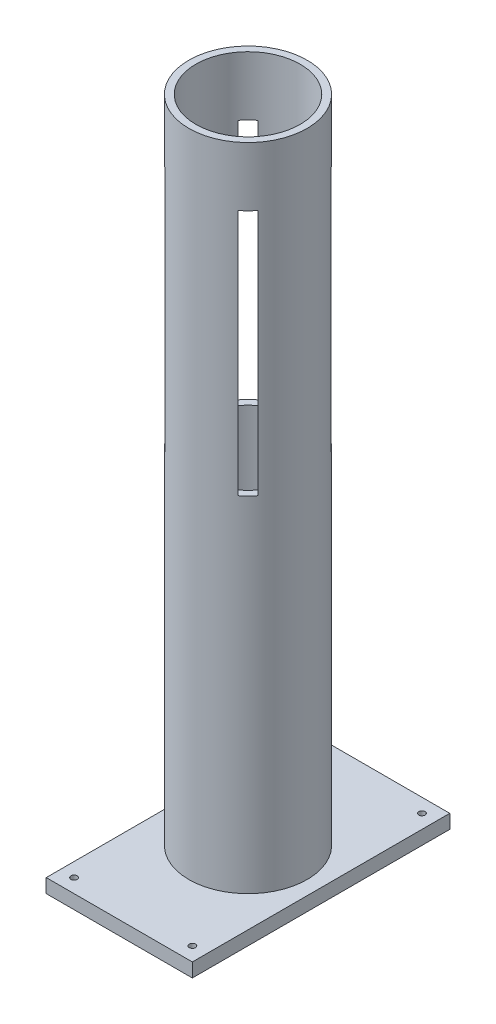
ISO-10303-21;
HEADER;
FILE_DESCRIPTION(('STEP AP214'),'2;1');
FILE_NAME('part.step','',(''),(''),'','','');
FILE_SCHEMA(('AUTOMOTIVE_DESIGN { 1 0 10303 214 1 1 1 1 }'));
ENDSEC;
DATA;
#1=APPLICATION_CONTEXT('core data for automotive mechanical design processes');
#2=APPLICATION_PROTOCOL_DEFINITION('international standard','automotive_design',2000,#1);
#3=PRODUCT_CONTEXT('',#1,'mechanical');
#4=PRODUCT('Part','Part','',(#3));
#5=PRODUCT_RELATED_PRODUCT_CATEGORY('part','',(#4));
#6=PRODUCT_DEFINITION_FORMATION('','',#4);
#7=PRODUCT_DEFINITION_CONTEXT('part definition',#1,'design');
#8=PRODUCT_DEFINITION('design','',#6,#7);
#9=PRODUCT_DEFINITION_SHAPE('','',#8);
#10=(LENGTH_UNIT() NAMED_UNIT(*) SI_UNIT(.MILLI.,.METRE.));
#11=(NAMED_UNIT(*) PLANE_ANGLE_UNIT() SI_UNIT($,.RADIAN.));
#12=(NAMED_UNIT(*) SI_UNIT($,.STERADIAN.) SOLID_ANGLE_UNIT());
#13=UNCERTAINTY_MEASURE_WITH_UNIT(LENGTH_MEASURE(1.E-05),#10,'distance_accuracy_value','');
#14=(GEOMETRIC_REPRESENTATION_CONTEXT(3) GLOBAL_UNCERTAINTY_ASSIGNED_CONTEXT((#13)) GLOBAL_UNIT_ASSIGNED_CONTEXT((#10,
#11,#12)) REPRESENTATION_CONTEXT('',''));
#15=CARTESIAN_POINT('',(0.,0.,0.));
#16=DIRECTION('',(0.,0.,1.));
#17=DIRECTION('',(1.,0.,0.));
#18=AXIS2_PLACEMENT_3D('',#15,#16,#17);
#19=CARTESIAN_POINT('',(-85.,955.,165.));
#20=DIRECTION('',(0.,-1.,0.));
#21=DIRECTION('',(0.,0.,-1.));
#22=AXIS2_PLACEMENT_3D('',#19,#20,#21);
#23=CYLINDRICAL_SURFACE('',#22,4.50000000000001);
#24=CARTESIAN_POINT('',(-85.,20.,165.));
#25=DIRECTION('',(0.,-1.,0.));
#26=DIRECTION('',(0.,0.,-1.));
#27=AXIS2_PLACEMENT_3D('',#24,#25,#26);
#28=CIRCLE('',#27,4.50000000000001);
#29=CARTESIAN_POINT('',(-85.,20.,160.5));
#30=VERTEX_POINT('',#29);
#31=EDGE_CURVE('E292',#30,#30,#28,.T.);
#32=ORIENTED_EDGE('',*,*,#31,.F.);
#33=EDGE_LOOP('',(#32));
#34=FACE_BOUND('',#33,.T.);
#35=CARTESIAN_POINT('',(-85.,8.80000000000003,165.));
#36=DIRECTION('',(0.,-1.,0.));
#37=DIRECTION('',(0.,0.,-1.));
#38=AXIS2_PLACEMENT_3D('',#35,#36,#37);
#39=CIRCLE('',#38,4.50000000000001);
#40=CARTESIAN_POINT('',(-85.,8.80000000000003,160.5));
#41=VERTEX_POINT('',#40);
#42=EDGE_CURVE('E297',#41,#41,#39,.F.);
#43=ORIENTED_EDGE('',*,*,#42,.F.);
#44=EDGE_LOOP('',(#43));
#45=FACE_BOUND('',#44,.T.);
#46=ADVANCED_FACE('F39',(#34,#45),#23,.F.);
#47=CARTESIAN_POINT('',(85.,955.,165.));
#48=DIRECTION('',(0.,-1.,0.));
#49=DIRECTION('',(0.,0.,-1.));
#50=AXIS2_PLACEMENT_3D('',#47,#48,#49);
#51=CYLINDRICAL_SURFACE('',#50,4.50000000000001);
#52=CARTESIAN_POINT('',(85.,20.,165.));
#53=DIRECTION('',(0.,-1.,0.));
#54=DIRECTION('',(0.,0.,-1.));
#55=AXIS2_PLACEMENT_3D('',#52,#53,#54);
#56=CIRCLE('',#55,4.50000000000001);
#57=CARTESIAN_POINT('',(85.,20.,160.5));
#58=VERTEX_POINT('',#57);
#59=EDGE_CURVE('E296',#58,#58,#56,.T.);
#60=ORIENTED_EDGE('',*,*,#59,.F.);
#61=EDGE_LOOP('',(#60));
#62=FACE_BOUND('',#61,.T.);
#63=CARTESIAN_POINT('',(85.,8.80000000000003,165.));
#64=DIRECTION('',(0.,-1.,0.));
#65=DIRECTION('',(0.,0.,-1.));
#66=AXIS2_PLACEMENT_3D('',#63,#64,#65);
#67=CIRCLE('',#66,4.50000000000001);
#68=CARTESIAN_POINT('',(85.,8.80000000000003,160.5));
#69=VERTEX_POINT('',#68);
#70=EDGE_CURVE('E375',#69,#69,#67,.F.);
#71=ORIENTED_EDGE('',*,*,#70,.F.);
#72=EDGE_LOOP('',(#71));
#73=FACE_BOUND('',#72,.T.);
#74=ADVANCED_FACE('F483',(#62,#73),#51,.F.);
#75=CARTESIAN_POINT('',(85.,955.,-165.));
#76=DIRECTION('',(0.,-1.,0.));
#77=DIRECTION('',(0.,0.,-1.));
#78=AXIS2_PLACEMENT_3D('',#75,#76,#77);
#79=CYLINDRICAL_SURFACE('',#78,4.50000000000001);
#80=CARTESIAN_POINT('',(85.,20.,-165.));
#81=DIRECTION('',(0.,-1.,0.));
#82=DIRECTION('',(0.,0.,-1.));
#83=AXIS2_PLACEMENT_3D('',#80,#81,#82);
#84=CIRCLE('',#83,4.50000000000001);
#85=CARTESIAN_POINT('',(85.,20.,-169.5));
#86=VERTEX_POINT('',#85);
#87=EDGE_CURVE('E301',#86,#86,#84,.T.);
#88=ORIENTED_EDGE('',*,*,#87,.F.);
#89=EDGE_LOOP('',(#88));
#90=FACE_BOUND('',#89,.T.);
#91=CARTESIAN_POINT('',(85.,8.80000000000003,-165.));
#92=DIRECTION('',(0.,-1.,0.));
#93=DIRECTION('',(0.,0.,-1.));
#94=AXIS2_PLACEMENT_3D('',#91,#92,#93);
#95=CIRCLE('',#94,4.50000000000001);
#96=CARTESIAN_POINT('',(85.,8.80000000000003,-169.5));
#97=VERTEX_POINT('',#96);
#98=EDGE_CURVE('E371',#97,#97,#95,.F.);
#99=ORIENTED_EDGE('',*,*,#98,.F.);
#100=EDGE_LOOP('',(#99));
#101=FACE_BOUND('',#100,.T.);
#102=ADVANCED_FACE('F489',(#90,#101),#79,.F.);
#103=CARTESIAN_POINT('',(-85.,955.,-165.));
#104=DIRECTION('',(0.,-1.,0.));
#105=DIRECTION('',(0.,0.,-1.));
#106=AXIS2_PLACEMENT_3D('',#103,#104,#105);
#107=CYLINDRICAL_SURFACE('',#106,4.50000000000001);
#108=CARTESIAN_POINT('',(-85.,20.,-165.));
#109=DIRECTION('',(0.,-1.,0.));
#110=DIRECTION('',(0.,0.,-1.));
#111=AXIS2_PLACEMENT_3D('',#108,#109,#110);
#112=CIRCLE('',#111,4.50000000000001);
#113=CARTESIAN_POINT('',(-85.,20.,-169.5));
#114=VERTEX_POINT('',#113);
#115=EDGE_CURVE('E305',#114,#114,#112,.T.);
#116=ORIENTED_EDGE('',*,*,#115,.F.);
#117=EDGE_LOOP('',(#116));
#118=FACE_BOUND('',#117,.T.);
#119=CARTESIAN_POINT('',(-85.,8.80000000000003,-165.));
#120=DIRECTION('',(0.,-1.,0.));
#121=DIRECTION('',(0.,0.,-1.));
#122=AXIS2_PLACEMENT_3D('',#119,#120,#121);
#123=CIRCLE('',#122,4.50000000000001);
#124=CARTESIAN_POINT('',(-85.,8.80000000000003,-169.5));
#125=VERTEX_POINT('',#124);
#126=EDGE_CURVE('E288',#125,#125,#123,.F.);
#127=ORIENTED_EDGE('',*,*,#126,.F.);
#128=EDGE_LOOP('',(#127));
#129=FACE_BOUND('',#128,.T.);
#130=ADVANCED_FACE('F496',(#118,#129),#107,.F.);
#131=CARTESIAN_POINT('',(105.,20.,185.));
#132=DIRECTION('',(-1.,0.,0.));
#133=DIRECTION('',(0.,0.,1.));
#134=AXIS2_PLACEMENT_3D('',#131,#132,#133);
#135=PLANE('',#134);
#136=DIRECTION('',(0.,0.,-1.));
#137=VECTOR('',#136,1.);
#138=CARTESIAN_POINT('',(105.,0.,185.));
#139=LINE('',#138,#137);
#140=CARTESIAN_POINT('',(105.,0.,185.));
#141=VERTEX_POINT('',#140);
#142=CARTESIAN_POINT('',(105.,0.,-185.));
#143=VERTEX_POINT('',#142);
#144=EDGE_CURVE('E321',#141,#143,#139,.T.);
#145=ORIENTED_EDGE('',*,*,#144,.T.);
#146=DIRECTION('',(0.,-1.,0.));
#147=VECTOR('',#146,1.);
#148=CARTESIAN_POINT('',(105.,20.,-185.));
#149=LINE('',#148,#147);
#150=CARTESIAN_POINT('',(105.,20.,-185.));
#151=VERTEX_POINT('',#150);
#152=EDGE_CURVE('E327',#151,#143,#149,.T.);
#153=ORIENTED_EDGE('',*,*,#152,.F.);
#154=DIRECTION('',(0.,0.,-1.));
#155=VECTOR('',#154,1.);
#156=CARTESIAN_POINT('',(105.,20.,185.));
#157=LINE('',#156,#155);
#158=CARTESIAN_POINT('',(105.,20.,185.));
#159=VERTEX_POINT('',#158);
#160=EDGE_CURVE('E328',#159,#151,#157,.T.);
#161=ORIENTED_EDGE('',*,*,#160,.F.);
#162=DIRECTION('',(0.,-1.,0.));
#163=VECTOR('',#162,1.);
#164=CARTESIAN_POINT('',(105.,20.,185.));
#165=LINE('',#164,#163);
#166=EDGE_CURVE('E342',#159,#141,#165,.T.);
#167=ORIENTED_EDGE('',*,*,#166,.T.);
#168=EDGE_LOOP('',(#145,#153,#161,#167));
#169=FACE_BOUND('',#168,.T.);
#170=ADVANCED_FACE('F41',(#169),#135,.F.);
#171=CARTESIAN_POINT('',(-105.,20.,-185.));
#172=DIRECTION('',(0.,0.,1.));
#173=DIRECTION('',(1.,0.,0.));
#174=AXIS2_PLACEMENT_3D('',#171,#172,#173);
#175=PLANE('',#174);
#176=DIRECTION('',(-1.,0.,0.));
#177=VECTOR('',#176,1.);
#178=CARTESIAN_POINT('',(-105.,0.,-185.));
#179=LINE('',#178,#177);
#180=CARTESIAN_POINT('',(-105.,0.,-185.));
#181=VERTEX_POINT('',#180);
#182=EDGE_CURVE('E346',#143,#181,#179,.T.);
#183=ORIENTED_EDGE('',*,*,#182,.T.);
#184=DIRECTION('',(0.,-1.,0.));
#185=VECTOR('',#184,1.);
#186=CARTESIAN_POINT('',(-105.,20.,-185.));
#187=LINE('',#186,#185);
#188=CARTESIAN_POINT('',(-105.,20.,-185.));
#189=VERTEX_POINT('',#188);
#190=EDGE_CURVE('E361',#189,#181,#187,.T.);
#191=ORIENTED_EDGE('',*,*,#190,.F.);
#192=DIRECTION('',(-1.,0.,0.));
#193=VECTOR('',#192,1.);
#194=CARTESIAN_POINT('',(-105.,20.,-185.));
#195=LINE('',#194,#193);
#196=EDGE_CURVE('E332',#151,#189,#195,.T.);
#197=ORIENTED_EDGE('',*,*,#196,.F.);
#198=ORIENTED_EDGE('',*,*,#152,.T.);
#199=EDGE_LOOP('',(#183,#191,#197,#198));
#200=FACE_BOUND('',#199,.T.);
#201=ADVANCED_FACE('F521',(#200),#175,.F.);
#202=CARTESIAN_POINT('',(-105.,20.,185.));
#203=DIRECTION('',(1.,0.,0.));
#204=DIRECTION('',(0.,0.,-1.));
#205=AXIS2_PLACEMENT_3D('',#202,#203,#204);
#206=PLANE('',#205);
#207=DIRECTION('',(0.,0.,1.));
#208=VECTOR('',#207,1.);
#209=CARTESIAN_POINT('',(-105.,0.,185.));
#210=LINE('',#209,#208);
#211=CARTESIAN_POINT('',(-105.,0.,185.));
#212=VERTEX_POINT('',#211);
#213=EDGE_CURVE('E349',#181,#212,#210,.T.);
#214=ORIENTED_EDGE('',*,*,#213,.T.);
#215=DIRECTION('',(0.,-1.,0.));
#216=VECTOR('',#215,1.);
#217=CARTESIAN_POINT('',(-105.,20.,185.));
#218=LINE('',#217,#216);
#219=CARTESIAN_POINT('',(-105.,20.,185.));
#220=VERTEX_POINT('',#219);
#221=EDGE_CURVE('E357',#220,#212,#218,.T.);
#222=ORIENTED_EDGE('',*,*,#221,.F.);
#223=DIRECTION('',(0.,0.,1.));
#224=VECTOR('',#223,1.);
#225=CARTESIAN_POINT('',(-105.,20.,185.));
#226=LINE('',#225,#224);
#227=EDGE_CURVE('E336',#189,#220,#226,.T.);
#228=ORIENTED_EDGE('',*,*,#227,.F.);
#229=ORIENTED_EDGE('',*,*,#190,.T.);
#230=EDGE_LOOP('',(#214,#222,#228,#229));
#231=FACE_BOUND('',#230,.T.);
#232=ADVANCED_FACE('F518',(#231),#206,.F.);
#233=CARTESIAN_POINT('',(-105.,20.,185.));
#234=DIRECTION('',(0.,0.,-1.));
#235=DIRECTION('',(-1.,0.,0.));
#236=AXIS2_PLACEMENT_3D('',#233,#234,#235);
#237=PLANE('',#236);
#238=DIRECTION('',(1.,0.,0.));
#239=VECTOR('',#238,1.);
#240=CARTESIAN_POINT('',(-105.,0.,185.));
#241=LINE('',#240,#239);
#242=EDGE_CURVE('E333',#212,#141,#241,.T.);
#243=ORIENTED_EDGE('',*,*,#242,.T.);
#244=ORIENTED_EDGE('',*,*,#166,.F.);
#245=DIRECTION('',(1.,0.,0.));
#246=VECTOR('',#245,1.);
#247=CARTESIAN_POINT('',(-105.,20.,185.));
#248=LINE('',#247,#246);
#249=EDGE_CURVE('E339',#220,#159,#248,.T.);
#250=ORIENTED_EDGE('',*,*,#249,.F.);
#251=ORIENTED_EDGE('',*,*,#221,.T.);
#252=EDGE_LOOP('',(#243,#244,#250,#251));
#253=FACE_BOUND('',#252,.T.);
#254=ADVANCED_FACE('F511',(#253),#237,.F.);
#255=CARTESIAN_POINT('',(0.,20.,0.));
#256=DIRECTION('',(0.,-1.,0.));
#257=DIRECTION('',(0.,0.,-1.));
#258=AXIS2_PLACEMENT_3D('',#255,#256,#257);
#259=PLANE('',#258);
#260=ORIENTED_EDGE('',*,*,#115,.T.);
#261=EDGE_LOOP('',(#260));
#262=FACE_BOUND('',#261,.T.);
#263=ORIENTED_EDGE('',*,*,#87,.T.);
#264=EDGE_LOOP('',(#263));
#265=FACE_BOUND('',#264,.T.);
#266=ORIENTED_EDGE('',*,*,#59,.T.);
#267=EDGE_LOOP('',(#266));
#268=FACE_BOUND('',#267,.T.);
#269=ORIENTED_EDGE('',*,*,#31,.T.);
#270=EDGE_LOOP('',(#269));
#271=FACE_BOUND('',#270,.T.);
#272=CARTESIAN_POINT('',(0.,20.,0.));
#273=DIRECTION('',(0.,1.,0.));
#274=DIRECTION('',(0.,0.,1.));
#275=AXIS2_PLACEMENT_3D('',#272,#273,#274);
#276=CIRCLE('',#275,85.);
#277=CARTESIAN_POINT('',(0.,20.,85.));
#278=VERTEX_POINT('',#277);
#279=EDGE_CURVE('E322',#278,#278,#276,.T.);
#280=ORIENTED_EDGE('',*,*,#279,.F.);
#281=EDGE_LOOP('',(#280));
#282=FACE_BOUND('',#281,.T.);
#283=ORIENTED_EDGE('',*,*,#160,.T.);
#284=ORIENTED_EDGE('',*,*,#196,.T.);
#285=ORIENTED_EDGE('',*,*,#227,.T.);
#286=ORIENTED_EDGE('',*,*,#249,.T.);
#287=EDGE_LOOP('',(#283,#284,#285,#286));
#288=FACE_BOUND('',#287,.T.);
#289=ADVANCED_FACE('F508',(#262,#265,#268,#271,#282,#288),#259,.F.);
#290=CARTESIAN_POINT('',(0.,0.,0.));
#291=DIRECTION('',(0.,-1.,0.));
#292=DIRECTION('',(0.,0.,-1.));
#293=AXIS2_PLACEMENT_3D('',#290,#291,#292);
#294=PLANE('',#293);
#295=CARTESIAN_POINT('',(-85.,0.,-165.));
#296=DIRECTION('',(0.,-1.,0.));
#297=DIRECTION('',(0.,0.,-1.));
#298=AXIS2_PLACEMENT_3D('',#295,#296,#297);
#299=CIRCLE('',#298,9.);
#300=CARTESIAN_POINT('',(-85.,0.,-174.));
#301=VERTEX_POINT('',#300);
#302=EDGE_CURVE('E280',#301,#301,#299,.T.);
#303=ORIENTED_EDGE('',*,*,#302,.F.);
#304=EDGE_LOOP('',(#303));
#305=FACE_BOUND('',#304,.T.);
#306=CARTESIAN_POINT('',(85.,0.,-165.));
#307=DIRECTION('',(0.,-1.,0.));
#308=DIRECTION('',(0.,0.,-1.));
#309=AXIS2_PLACEMENT_3D('',#306,#307,#308);
#310=CIRCLE('',#309,9.);
#311=CARTESIAN_POINT('',(85.,0.,-174.));
#312=VERTEX_POINT('',#311);
#313=EDGE_CURVE('E272',#312,#312,#310,.T.);
#314=ORIENTED_EDGE('',*,*,#313,.F.);
#315=EDGE_LOOP('',(#314));
#316=FACE_BOUND('',#315,.T.);
#317=CARTESIAN_POINT('',(85.,0.,165.));
#318=DIRECTION('',(0.,-1.,0.));
#319=DIRECTION('',(0.,0.,-1.));
#320=AXIS2_PLACEMENT_3D('',#317,#318,#319);
#321=CIRCLE('',#320,9.);
#322=CARTESIAN_POINT('',(85.,0.,156.));
#323=VERTEX_POINT('',#322);
#324=EDGE_CURVE('E264',#323,#323,#321,.T.);
#325=ORIENTED_EDGE('',*,*,#324,.F.);
#326=EDGE_LOOP('',(#325));
#327=FACE_BOUND('',#326,.T.);
#328=CARTESIAN_POINT('',(-85.,0.,165.));
#329=DIRECTION('',(0.,-1.,0.));
#330=DIRECTION('',(0.,0.,-1.));
#331=AXIS2_PLACEMENT_3D('',#328,#329,#330);
#332=CIRCLE('',#331,9.);
#333=CARTESIAN_POINT('',(-85.,0.,156.));
#334=VERTEX_POINT('',#333);
#335=EDGE_CURVE('E263',#334,#334,#332,.T.);
#336=ORIENTED_EDGE('',*,*,#335,.F.);
#337=EDGE_LOOP('',(#336));
#338=FACE_BOUND('',#337,.T.);
#339=CARTESIAN_POINT('',(0.,0.,0.));
#340=DIRECTION('',(0.,1.,0.));
#341=DIRECTION('',(0.,0.,1.));
#342=AXIS2_PLACEMENT_3D('',#339,#340,#341);
#343=CIRCLE('',#342,75.);
#344=CARTESIAN_POINT('',(0.,0.,75.));
#345=VERTEX_POINT('',#344);
#346=EDGE_CURVE('E310',#345,#345,#343,.T.);
#347=ORIENTED_EDGE('',*,*,#346,.T.);
#348=EDGE_LOOP('',(#347));
#349=FACE_BOUND('',#348,.T.);
#350=ORIENTED_EDGE('',*,*,#144,.F.);
#351=ORIENTED_EDGE('',*,*,#242,.F.);
#352=ORIENTED_EDGE('',*,*,#213,.F.);
#353=ORIENTED_EDGE('',*,*,#182,.F.);
#354=EDGE_LOOP('',(#350,#351,#352,#353));
#355=FACE_BOUND('',#354,.T.);
#356=ADVANCED_FACE('F507',(#305,#316,#327,#338,#349,#355),#294,.T.);
#357=CARTESIAN_POINT('',(0.,955.,0.));
#358=DIRECTION('',(0.,-1.,0.));
#359=DIRECTION('',(0.,0.,-1.));
#360=AXIS2_PLACEMENT_3D('',#357,#358,#359);
#361=CYLINDRICAL_SURFACE('',#360,85.);
#362=DIRECTION('',(0.,-1.,0.));
#363=VECTOR('',#362,1.);
#364=CARTESIAN_POINT('',(-66.7577497434322,955.,52.6156141197011));
#365=LINE('',#364,#363);
#366=CARTESIAN_POINT('',(-66.7577497434322,515.,52.6156141197011));
#367=VERTEX_POINT('',#366);
#368=CARTESIAN_POINT('',(-66.7577497434321,870.,52.6156141197011));
#369=VERTEX_POINT('',#368);
#370=EDGE_CURVE('E203',#367,#369,#365,.F.);
#371=ORIENTED_EDGE('',*,*,#370,.T.);
#372=CARTESIAN_POINT('',(0.,870.,0.));
#373=DIRECTION('',(0.,1.,0.));
#374=DIRECTION('',(0.,0.,1.));
#375=AXIS2_PLACEMENT_3D('',#372,#373,#374);
#376=CIRCLE('',#375,85.);
#377=CARTESIAN_POINT('',(-52.6156141197012,870.,66.757749743432));
#378=VERTEX_POINT('',#377);
#379=EDGE_CURVE('E193',#369,#378,#376,.T.);
#380=ORIENTED_EDGE('',*,*,#379,.T.);
#381=DIRECTION('',(0.,-1.,0.));
#382=VECTOR('',#381,1.);
#383=CARTESIAN_POINT('',(-52.6156141197012,955.,66.757749743432));
#384=LINE('',#383,#382);
#385=CARTESIAN_POINT('',(-52.6156141197012,515.,66.757749743432));
#386=VERTEX_POINT('',#385);
#387=EDGE_CURVE('E178',#378,#386,#384,.T.);
#388=ORIENTED_EDGE('',*,*,#387,.T.);
#389=CARTESIAN_POINT('',(0.,515.,0.));
#390=DIRECTION('',(0.,-1.,0.));
#391=DIRECTION('',(0.,0.,-1.));
#392=AXIS2_PLACEMENT_3D('',#389,#390,#391);
#393=CIRCLE('',#392,85.);
#394=EDGE_CURVE('E187',#386,#367,#393,.T.);
#395=ORIENTED_EDGE('',*,*,#394,.T.);
#396=EDGE_LOOP('',(#371,#380,#388,#395));
#397=FACE_BOUND('',#396,.T.);
#398=DIRECTION('',(0.,-1.,0.));
#399=VECTOR('',#398,1.);
#400=CARTESIAN_POINT('',(52.6156141197013,955.,-66.757749743432));
#401=LINE('',#400,#399);
#402=CARTESIAN_POINT('',(52.6156141197013,870.,-66.757749743432));
#403=VERTEX_POINT('',#402);
#404=CARTESIAN_POINT('',(52.6156141197013,515.,-66.757749743432));
#405=VERTEX_POINT('',#404);
#406=EDGE_CURVE('E206',#403,#405,#401,.T.);
#407=ORIENTED_EDGE('',*,*,#406,.T.);
#408=CARTESIAN_POINT('',(66.7577497434322,515.,-52.615614119701));
#409=VERTEX_POINT('',#408);
#410=EDGE_CURVE('E442',#405,#409,#393,.T.);
#411=ORIENTED_EDGE('',*,*,#410,.T.);
#412=DIRECTION('',(0.,-1.,0.));
#413=VECTOR('',#412,1.);
#414=CARTESIAN_POINT('',(66.7577497434322,955.,-52.615614119701));
#415=LINE('',#414,#413);
#416=CARTESIAN_POINT('',(66.7577497434322,870.,-52.615614119701));
#417=VERTEX_POINT('',#416);
#418=EDGE_CURVE('E188',#409,#417,#415,.F.);
#419=ORIENTED_EDGE('',*,*,#418,.T.);
#420=EDGE_CURVE('E205',#417,#403,#376,.T.);
#421=ORIENTED_EDGE('',*,*,#420,.T.);
#422=EDGE_LOOP('',(#407,#411,#419,#421));
#423=FACE_BOUND('',#422,.T.);
#424=DIRECTION('',(0.,-1.,0.));
#425=VECTOR('',#424,1.);
#426=CARTESIAN_POINT('',(-52.6156141197008,955.,-66.7577497434323));
#427=LINE('',#426,#425);
#428=CARTESIAN_POINT('',(-52.6156141197008,515.,-66.7577497434323));
#429=VERTEX_POINT('',#428);
#430=CARTESIAN_POINT('',(-52.6156141197008,870.,-66.7577497434324));
#431=VERTEX_POINT('',#430);
#432=EDGE_CURVE('E246',#429,#431,#427,.F.);
#433=ORIENTED_EDGE('',*,*,#432,.T.);
#434=CARTESIAN_POINT('',(0.,870.,0.));
#435=DIRECTION('',(0.,1.,0.));
#436=DIRECTION('',(0.,0.,1.));
#437=AXIS2_PLACEMENT_3D('',#434,#435,#436);
#438=CIRCLE('',#437,85.);
#439=CARTESIAN_POINT('',(-66.7577497434318,870.,-52.6156141197015));
#440=VERTEX_POINT('',#439);
#441=EDGE_CURVE('E254',#431,#440,#438,.T.);
#442=ORIENTED_EDGE('',*,*,#441,.T.);
#443=DIRECTION('',(0.,-1.,0.));
#444=VECTOR('',#443,1.);
#445=CARTESIAN_POINT('',(-66.7577497434318,955.,-52.6156141197015));
#446=LINE('',#445,#444);
#447=CARTESIAN_POINT('',(-66.7577497434318,515.,-52.6156141197015));
#448=VERTEX_POINT('',#447);
#449=EDGE_CURVE('E237',#440,#448,#446,.T.);
#450=ORIENTED_EDGE('',*,*,#449,.T.);
#451=CARTESIAN_POINT('',(0.,515.,0.));
#452=DIRECTION('',(0.,-1.,0.));
#453=DIRECTION('',(0.,0.,-1.));
#454=AXIS2_PLACEMENT_3D('',#451,#452,#453);
#455=CIRCLE('',#454,85.);
#456=EDGE_CURVE('E241',#448,#429,#455,.T.);
#457=ORIENTED_EDGE('',*,*,#456,.T.);
#458=EDGE_LOOP('',(#433,#442,#450,#457));
#459=FACE_BOUND('',#458,.T.);
#460=DIRECTION('',(0.,-1.,0.));
#461=VECTOR('',#460,1.);
#462=CARTESIAN_POINT('',(66.7577497434318,955.,52.6156141197015));
#463=LINE('',#462,#461);
#464=CARTESIAN_POINT('',(66.7577497434317,870.,52.6156141197014));
#465=VERTEX_POINT('',#464);
#466=CARTESIAN_POINT('',(66.7577497434318,515.,52.6156141197015));
#467=VERTEX_POINT('',#466);
#468=EDGE_CURVE('E250',#465,#467,#463,.T.);
#469=ORIENTED_EDGE('',*,*,#468,.T.);
#470=CARTESIAN_POINT('',(52.6156141197007,515.,66.7577497434323));
#471=VERTEX_POINT('',#470);
#472=EDGE_CURVE('E245',#467,#471,#455,.T.);
#473=ORIENTED_EDGE('',*,*,#472,.T.);
#474=DIRECTION('',(0.,-1.,0.));
#475=VECTOR('',#474,1.);
#476=CARTESIAN_POINT('',(52.6156141197008,955.,66.7577497434323));
#477=LINE('',#476,#475);
#478=CARTESIAN_POINT('',(52.6156141197008,870.,66.7577497434323));
#479=VERTEX_POINT('',#478);
#480=EDGE_CURVE('E233',#471,#479,#477,.F.);
#481=ORIENTED_EDGE('',*,*,#480,.T.);
#482=EDGE_CURVE('E258',#479,#465,#438,.T.);
#483=ORIENTED_EDGE('',*,*,#482,.T.);
#484=EDGE_LOOP('',(#469,#473,#481,#483));
#485=FACE_BOUND('',#484,.T.);
#486=CARTESIAN_POINT('',(0.,955.,0.));
#487=DIRECTION('',(0.,1.,0.));
#488=DIRECTION('',(0.,0.,1.));
#489=AXIS2_PLACEMENT_3D('',#486,#487,#488);
#490=CIRCLE('',#489,85.);
#491=CARTESIAN_POINT('',(0.,955.,85.));
#492=VERTEX_POINT('',#491);
#493=EDGE_CURVE('E314',#492,#492,#490,.T.);
#494=ORIENTED_EDGE('',*,*,#493,.F.);
#495=EDGE_LOOP('',(#494));
#496=FACE_BOUND('',#495,.T.);
#497=ORIENTED_EDGE('',*,*,#279,.T.);
#498=EDGE_LOOP('',(#497));
#499=FACE_BOUND('',#498,.T.);
#500=ADVANCED_FACE('F201',(#397,#423,#459,#485,#496,#499),#361,.T.);
#501=CARTESIAN_POINT('',(0.,955.,0.));
#502=DIRECTION('',(0.,1.,0.));
#503=DIRECTION('',(0.,0.,1.));
#504=AXIS2_PLACEMENT_3D('',#501,#502,#503);
#505=PLANE('',#504);
#506=CARTESIAN_POINT('',(0.,955.,0.));
#507=DIRECTION('',(0.,1.,0.));
#508=DIRECTION('',(0.,0.,1.));
#509=AXIS2_PLACEMENT_3D('',#506,#507,#508);
#510=CIRCLE('',#509,75.);
#511=CARTESIAN_POINT('',(0.,955.,75.));
#512=VERTEX_POINT('',#511);
#513=EDGE_CURVE('E309',#512,#512,#510,.T.);
#514=ORIENTED_EDGE('',*,*,#513,.F.);
#515=EDGE_LOOP('',(#514));
#516=FACE_BOUND('',#515,.T.);
#517=ORIENTED_EDGE('',*,*,#493,.T.);
#518=EDGE_LOOP('',(#517));
#519=FACE_BOUND('',#518,.T.);
#520=ADVANCED_FACE('F501',(#516,#519),#505,.T.);
#521=CARTESIAN_POINT('',(0.,0.,0.));
#522=DIRECTION('',(0.,1.,0.));
#523=DIRECTION('',(0.,0.,1.));
#524=AXIS2_PLACEMENT_3D('',#521,#522,#523);
#525=CYLINDRICAL_SURFACE('',#524,75.);
#526=DIRECTION('',(0.,1.,0.));
#527=VECTOR('',#526,1.);
#528=CARTESIAN_POINT('',(45.4884222922063,0.,-59.630557915937));
#529=LINE('',#528,#527);
#530=CARTESIAN_POINT('',(45.4884222922063,515.,-59.630557915937));
#531=VERTEX_POINT('',#530);
#532=CARTESIAN_POINT('',(45.4884222922063,870.,-59.630557915937));
#533=VERTEX_POINT('',#532);
#534=EDGE_CURVE('E43',#531,#533,#529,.T.);
#535=ORIENTED_EDGE('',*,*,#534,.T.);
#536=CARTESIAN_POINT('',(0.,870.,0.));
#537=DIRECTION('',(0.,1.,0.));
#538=DIRECTION('',(0.,0.,1.));
#539=AXIS2_PLACEMENT_3D('',#536,#537,#538);
#540=CIRCLE('',#539,75.);
#541=CARTESIAN_POINT('',(59.6305579159372,870.,-45.488422292206));
#542=VERTEX_POINT('',#541);
#543=EDGE_CURVE('E11',#533,#542,#540,.F.);
#544=ORIENTED_EDGE('',*,*,#543,.T.);
#545=DIRECTION('',(0.,1.,0.));
#546=VECTOR('',#545,1.);
#547=CARTESIAN_POINT('',(59.6305579159372,0.,-45.488422292206));
#548=LINE('',#547,#546);
#549=CARTESIAN_POINT('',(59.6305579159372,515.,-45.488422292206));
#550=VERTEX_POINT('',#549);
#551=EDGE_CURVE('E419',#542,#550,#548,.F.);
#552=ORIENTED_EDGE('',*,*,#551,.T.);
#553=CARTESIAN_POINT('',(0.,515.,0.));
#554=DIRECTION('',(0.,-1.,0.));
#555=DIRECTION('',(0.,0.,-1.));
#556=AXIS2_PLACEMENT_3D('',#553,#554,#555);
#557=CIRCLE('',#556,75.);
#558=EDGE_CURVE('E415',#550,#531,#557,.F.);
#559=ORIENTED_EDGE('',*,*,#558,.T.);
#560=EDGE_LOOP('',(#535,#544,#552,#559));
#561=FACE_BOUND('',#560,.T.);
#562=DIRECTION('',(0.,1.,0.));
#563=VECTOR('',#562,1.);
#564=CARTESIAN_POINT('',(-45.4884222922062,0.,59.630557915937));
#565=LINE('',#564,#563);
#566=CARTESIAN_POINT('',(-45.4884222922062,515.,59.630557915937));
#567=VERTEX_POINT('',#566);
#568=CARTESIAN_POINT('',(-45.4884222922062,870.,59.630557915937));
#569=VERTEX_POINT('',#568);
#570=EDGE_CURVE('E407',#567,#569,#565,.T.);
#571=ORIENTED_EDGE('',*,*,#570,.T.);
#572=CARTESIAN_POINT('',(-59.6305579159371,870.,45.4884222922061));
#573=VERTEX_POINT('',#572);
#574=EDGE_CURVE('E50',#569,#573,#540,.F.);
#575=ORIENTED_EDGE('',*,*,#574,.T.);
#576=DIRECTION('',(0.,1.,0.));
#577=VECTOR('',#576,1.);
#578=CARTESIAN_POINT('',(-59.6305579159371,0.,45.4884222922061));
#579=LINE('',#578,#577);
#580=CARTESIAN_POINT('',(-59.6305579159371,515.,45.4884222922061));
#581=VERTEX_POINT('',#580);
#582=EDGE_CURVE('E414',#573,#581,#579,.F.);
#583=ORIENTED_EDGE('',*,*,#582,.T.);
#584=EDGE_CURVE('E410',#581,#567,#557,.F.);
#585=ORIENTED_EDGE('',*,*,#584,.T.);
#586=EDGE_LOOP('',(#571,#575,#583,#585));
#587=FACE_BOUND('',#586,.T.);
#588=DIRECTION('',(0.,1.,0.));
#589=VECTOR('',#588,1.);
#590=CARTESIAN_POINT('',(59.6305579159368,0.,45.4884222922064));
#591=LINE('',#590,#589);
#592=CARTESIAN_POINT('',(59.6305579159368,515.,45.4884222922064));
#593=VERTEX_POINT('',#592);
#594=CARTESIAN_POINT('',(59.6305579159368,870.,45.4884222922064));
#595=VERTEX_POINT('',#594);
#596=EDGE_CURVE('E403',#593,#595,#591,.T.);
#597=ORIENTED_EDGE('',*,*,#596,.T.);
#598=CARTESIAN_POINT('',(0.,870.,0.));
#599=DIRECTION('',(0.,1.,0.));
#600=DIRECTION('',(0.,0.,1.));
#601=AXIS2_PLACEMENT_3D('',#598,#599,#600);
#602=CIRCLE('',#601,75.);
#603=CARTESIAN_POINT('',(45.4884222922058,870.,59.6305579159373));
#604=VERTEX_POINT('',#603);
#605=EDGE_CURVE('E399',#595,#604,#602,.F.);
#606=ORIENTED_EDGE('',*,*,#605,.T.);
#607=DIRECTION('',(0.,1.,0.));
#608=VECTOR('',#607,1.);
#609=CARTESIAN_POINT('',(45.4884222922058,0.,59.6305579159373));
#610=LINE('',#609,#608);
#611=CARTESIAN_POINT('',(45.4884222922058,515.,59.6305579159373));
#612=VERTEX_POINT('',#611);
#613=EDGE_CURVE('E398',#604,#612,#610,.F.);
#614=ORIENTED_EDGE('',*,*,#613,.T.);
#615=CARTESIAN_POINT('',(0.,515.,0.));
#616=DIRECTION('',(0.,-1.,0.));
#617=DIRECTION('',(0.,0.,-1.));
#618=AXIS2_PLACEMENT_3D('',#615,#616,#617);
#619=CIRCLE('',#618,75.);
#620=EDGE_CURVE('E390',#612,#593,#619,.F.);
#621=ORIENTED_EDGE('',*,*,#620,.T.);
#622=EDGE_LOOP('',(#597,#606,#614,#621));
#623=FACE_BOUND('',#622,.T.);
#624=DIRECTION('',(0.,1.,0.));
#625=VECTOR('',#624,1.);
#626=CARTESIAN_POINT('',(-59.6305579159368,0.,-45.4884222922064));
#627=LINE('',#626,#625);
#628=CARTESIAN_POINT('',(-59.6305579159369,515.,-45.4884222922065));
#629=VERTEX_POINT('',#628);
#630=CARTESIAN_POINT('',(-59.6305579159368,870.,-45.4884222922064));
#631=VERTEX_POINT('',#630);
#632=EDGE_CURVE('E326',#629,#631,#627,.T.);
#633=ORIENTED_EDGE('',*,*,#632,.T.);
#634=CARTESIAN_POINT('',(-45.4884222922059,870.,-59.6305579159373));
#635=VERTEX_POINT('',#634);
#636=EDGE_CURVE('E394',#631,#635,#602,.F.);
#637=ORIENTED_EDGE('',*,*,#636,.T.);
#638=DIRECTION('',(0.,1.,0.));
#639=VECTOR('',#638,1.);
#640=CARTESIAN_POINT('',(-45.4884222922058,0.,-59.6305579159373));
#641=LINE('',#640,#639);
#642=CARTESIAN_POINT('',(-45.4884222922058,515.,-59.6305579159373));
#643=VERTEX_POINT('',#642);
#644=EDGE_CURVE('E389',#635,#643,#641,.F.);
#645=ORIENTED_EDGE('',*,*,#644,.T.);
#646=EDGE_CURVE('E385',#643,#629,#619,.F.);
#647=ORIENTED_EDGE('',*,*,#646,.T.);
#648=EDGE_LOOP('',(#633,#637,#645,#647));
#649=FACE_BOUND('',#648,.T.);
#650=ORIENTED_EDGE('',*,*,#346,.F.);
#651=EDGE_LOOP('',(#650));
#652=FACE_BOUND('',#651,.T.);
#653=ORIENTED_EDGE('',*,*,#513,.T.);
#654=EDGE_LOOP('',(#653));
#655=FACE_BOUND('',#654,.T.);
#656=ADVANCED_FACE('F428',(#561,#587,#623,#649,#652,#655),#525,.F.);
#657=CARTESIAN_POINT('',(-85.,8.8,-165.));
#658=DIRECTION('',(0.,-1.,0.));
#659=DIRECTION('',(0.,0.,-1.));
#660=AXIS2_PLACEMENT_3D('',#657,#658,#659);
#661=PLANE('',#660);
#662=CARTESIAN_POINT('',(-85.,8.8,-165.));
#663=DIRECTION('',(0.,-1.,0.));
#664=DIRECTION('',(0.,0.,-1.));
#665=AXIS2_PLACEMENT_3D('',#662,#663,#664);
#666=CIRCLE('',#665,9.);
#667=CARTESIAN_POINT('',(-85.,8.8,-174.));
#668=VERTEX_POINT('',#667);
#669=EDGE_CURVE('E276',#668,#668,#666,.T.);
#670=ORIENTED_EDGE('',*,*,#669,.T.);
#671=EDGE_LOOP('',(#670));
#672=FACE_BOUND('',#671,.T.);
#673=ORIENTED_EDGE('',*,*,#126,.T.);
#674=EDGE_LOOP('',(#673));
#675=FACE_BOUND('',#674,.T.);
#676=ADVANCED_FACE('F500',(#672,#675),#661,.T.);
#677=CARTESIAN_POINT('',(-85.,8.8,-165.));
#678=DIRECTION('',(0.,-1.,0.));
#679=DIRECTION('',(0.,0.,-1.));
#680=AXIS2_PLACEMENT_3D('',#677,#678,#679);
#681=CYLINDRICAL_SURFACE('',#680,9.);
#682=ORIENTED_EDGE('',*,*,#669,.F.);
#683=EDGE_LOOP('',(#682));
#684=FACE_BOUND('',#683,.T.);
#685=ORIENTED_EDGE('',*,*,#302,.T.);
#686=EDGE_LOOP('',(#685));
#687=FACE_BOUND('',#686,.T.);
#688=ADVANCED_FACE('F554',(#684,#687),#681,.F.);
#689=CARTESIAN_POINT('',(85.,8.8,-165.));
#690=DIRECTION('',(0.,-1.,0.));
#691=DIRECTION('',(0.,0.,-1.));
#692=AXIS2_PLACEMENT_3D('',#689,#690,#691);
#693=PLANE('',#692);
#694=CARTESIAN_POINT('',(85.,8.8,-165.));
#695=DIRECTION('',(0.,-1.,0.));
#696=DIRECTION('',(0.,0.,-1.));
#697=AXIS2_PLACEMENT_3D('',#694,#695,#696);
#698=CIRCLE('',#697,9.);
#699=CARTESIAN_POINT('',(85.,8.8,-174.));
#700=VERTEX_POINT('',#699);
#701=EDGE_CURVE('E268',#700,#700,#698,.T.);
#702=ORIENTED_EDGE('',*,*,#701,.T.);
#703=EDGE_LOOP('',(#702));
#704=FACE_BOUND('',#703,.T.);
#705=ORIENTED_EDGE('',*,*,#98,.T.);
#706=EDGE_LOOP('',(#705));
#707=FACE_BOUND('',#706,.T.);
#708=ADVANCED_FACE('F560',(#704,#707),#693,.T.);
#709=CARTESIAN_POINT('',(85.,8.8,-165.));
#710=DIRECTION('',(0.,-1.,0.));
#711=DIRECTION('',(0.,0.,-1.));
#712=AXIS2_PLACEMENT_3D('',#709,#710,#711);
#713=CYLINDRICAL_SURFACE('',#712,9.);
#714=ORIENTED_EDGE('',*,*,#701,.F.);
#715=EDGE_LOOP('',(#714));
#716=FACE_BOUND('',#715,.T.);
#717=ORIENTED_EDGE('',*,*,#313,.T.);
#718=EDGE_LOOP('',(#717));
#719=FACE_BOUND('',#718,.T.);
#720=ADVANCED_FACE('F564',(#716,#719),#713,.F.);
#721=CARTESIAN_POINT('',(85.,8.8,165.));
#722=DIRECTION('',(0.,-1.,0.));
#723=DIRECTION('',(0.,0.,-1.));
#724=AXIS2_PLACEMENT_3D('',#721,#722,#723);
#725=PLANE('',#724);
#726=CARTESIAN_POINT('',(85.,8.8,165.));
#727=DIRECTION('',(0.,-1.,0.));
#728=DIRECTION('',(0.,0.,-1.));
#729=AXIS2_PLACEMENT_3D('',#726,#727,#728);
#730=CIRCLE('',#729,9.);
#731=CARTESIAN_POINT('',(85.,8.8,156.));
#732=VERTEX_POINT('',#731);
#733=EDGE_CURVE('E259',#732,#732,#730,.T.);
#734=ORIENTED_EDGE('',*,*,#733,.T.);
#735=EDGE_LOOP('',(#734));
#736=FACE_BOUND('',#735,.T.);
#737=ORIENTED_EDGE('',*,*,#70,.T.);
#738=EDGE_LOOP('',(#737));
#739=FACE_BOUND('',#738,.T.);
#740=ADVANCED_FACE('F657',(#736,#739),#725,.T.);
#741=CARTESIAN_POINT('',(85.,8.8,165.));
#742=DIRECTION('',(0.,-1.,0.));
#743=DIRECTION('',(0.,0.,-1.));
#744=AXIS2_PLACEMENT_3D('',#741,#742,#743);
#745=CYLINDRICAL_SURFACE('',#744,9.);
#746=ORIENTED_EDGE('',*,*,#733,.F.);
#747=EDGE_LOOP('',(#746));
#748=FACE_BOUND('',#747,.T.);
#749=ORIENTED_EDGE('',*,*,#324,.T.);
#750=EDGE_LOOP('',(#749));
#751=FACE_BOUND('',#750,.T.);
#752=ADVANCED_FACE('F571',(#748,#751),#745,.F.);
#753=CARTESIAN_POINT('',(-85.,8.8,165.));
#754=DIRECTION('',(0.,-1.,0.));
#755=DIRECTION('',(0.,0.,-1.));
#756=AXIS2_PLACEMENT_3D('',#753,#754,#755);
#757=PLANE('',#756);
#758=CARTESIAN_POINT('',(-85.,8.8,165.));
#759=DIRECTION('',(0.,-1.,0.));
#760=DIRECTION('',(0.,0.,-1.));
#761=AXIS2_PLACEMENT_3D('',#758,#759,#760);
#762=CIRCLE('',#761,9.);
#763=CARTESIAN_POINT('',(-85.,8.8,156.));
#764=VERTEX_POINT('',#763);
#765=EDGE_CURVE('E284',#764,#764,#762,.T.);
#766=ORIENTED_EDGE('',*,*,#765,.T.);
#767=EDGE_LOOP('',(#766));
#768=FACE_BOUND('',#767,.T.);
#769=ORIENTED_EDGE('',*,*,#42,.T.);
#770=EDGE_LOOP('',(#769));
#771=FACE_BOUND('',#770,.T.);
#772=ADVANCED_FACE('F567',(#768,#771),#757,.T.);
#773=CARTESIAN_POINT('',(-85.,8.8,165.));
#774=DIRECTION('',(0.,-1.,0.));
#775=DIRECTION('',(0.,0.,-1.));
#776=AXIS2_PLACEMENT_3D('',#773,#774,#775);
#777=CYLINDRICAL_SURFACE('',#776,9.);
#778=ORIENTED_EDGE('',*,*,#765,.F.);
#779=EDGE_LOOP('',(#778));
#780=FACE_BOUND('',#779,.T.);
#781=ORIENTED_EDGE('',*,*,#335,.T.);
#782=EDGE_LOOP('',(#781));
#783=FACE_BOUND('',#782,.T.);
#784=ADVANCED_FACE('F570',(#780,#783),#777,.F.);
#785=CARTESIAN_POINT('',(-152.071067811865,870.,-137.928932188136));
#786=DIRECTION('',(-0.707106781186551,0.,0.707106781186544));
#787=DIRECTION('',(0.707106781186544,0.,0.707106781186551));
#788=AXIS2_PLACEMENT_3D('',#785,#786,#787);
#789=PLANE('',#788);
#790=DIRECTION('',(0.707106781186544,0.,0.707106781186551));
#791=VECTOR('',#790,1.);
#792=CARTESIAN_POINT('',(-152.071067811865,870.,-137.928932188136));
#793=LINE('',#792,#791);
#794=EDGE_CURVE('E230',#440,#631,#793,.T.);
#795=ORIENTED_EDGE('',*,*,#794,.T.);
#796=ORIENTED_EDGE('',*,*,#632,.F.);
#797=DIRECTION('',(0.707106781186544,0.,0.707106781186551));
#798=VECTOR('',#797,1.);
#799=CARTESIAN_POINT('',(-152.071067811865,515.,-137.928932188136));
#800=LINE('',#799,#798);
#801=EDGE_CURVE('E225',#448,#629,#800,.T.);
#802=ORIENTED_EDGE('',*,*,#801,.F.);
#803=ORIENTED_EDGE('',*,*,#449,.F.);
#804=EDGE_LOOP('',(#795,#796,#802,#803));
#805=FACE_BOUND('',#804,.T.);
#806=ADVANCED_FACE('F574',(#805),#789,.F.);
#807=CARTESIAN_POINT('',(-152.071067811865,515.,-137.928932188136));
#808=DIRECTION('',(0.,-1.,0.));
#809=DIRECTION('',(0.,0.,-1.));
#810=AXIS2_PLACEMENT_3D('',#807,#808,#809);
#811=PLANE('',#810);
#812=ORIENTED_EDGE('',*,*,#801,.T.);
#813=ORIENTED_EDGE('',*,*,#646,.F.);
#814=DIRECTION('',(0.707106781186544,0.,0.707106781186551));
#815=VECTOR('',#814,1.);
#816=CARTESIAN_POINT('',(-137.928932188134,515.,-152.071067811866));
#817=LINE('',#816,#815);
#818=EDGE_CURVE('E220',#429,#643,#817,.T.);
#819=ORIENTED_EDGE('',*,*,#818,.F.);
#820=ORIENTED_EDGE('',*,*,#456,.F.);
#821=EDGE_LOOP('',(#812,#813,#819,#820));
#822=FACE_BOUND('',#821,.T.);
#823=ADVANCED_FACE('F579',(#822),#811,.F.);
#824=CARTESIAN_POINT('',(-137.928932188134,870.,-152.071067811866));
#825=DIRECTION('',(0.707106781186551,0.,-0.707106781186544));
#826=DIRECTION('',(-0.707106781186544,0.,-0.707106781186551));
#827=AXIS2_PLACEMENT_3D('',#824,#825,#826);
#828=PLANE('',#827);
#829=ORIENTED_EDGE('',*,*,#818,.T.);
#830=ORIENTED_EDGE('',*,*,#644,.F.);
#831=DIRECTION('',(0.707106781186544,0.,0.707106781186551));
#832=VECTOR('',#831,1.);
#833=CARTESIAN_POINT('',(-137.928932188134,870.,-152.071067811866));
#834=LINE('',#833,#832);
#835=EDGE_CURVE('E219',#431,#635,#834,.T.);
#836=ORIENTED_EDGE('',*,*,#835,.F.);
#837=ORIENTED_EDGE('',*,*,#432,.F.);
#838=EDGE_LOOP('',(#829,#830,#836,#837));
#839=FACE_BOUND('',#838,.T.);
#840=ADVANCED_FACE('F603',(#839),#828,.F.);
#841=CARTESIAN_POINT('',(-152.071067811865,870.,-137.928932188136));
#842=DIRECTION('',(0.,1.,0.));
#843=DIRECTION('',(0.,0.,1.));
#844=AXIS2_PLACEMENT_3D('',#841,#842,#843);
#845=PLANE('',#844);
#846=ORIENTED_EDGE('',*,*,#835,.T.);
#847=ORIENTED_EDGE('',*,*,#636,.F.);
#848=ORIENTED_EDGE('',*,*,#794,.F.);
#849=ORIENTED_EDGE('',*,*,#441,.F.);
#850=EDGE_LOOP('',(#846,#847,#848,#849));
#851=FACE_BOUND('',#850,.T.);
#852=ADVANCED_FACE('F640',(#851),#845,.F.);
#853=EDGE_CURVE('E210',#604,#479,#793,.T.);
#854=ORIENTED_EDGE('',*,*,#853,.F.);
#855=ORIENTED_EDGE('',*,*,#605,.F.);
#856=EDGE_CURVE('E215',#595,#465,#834,.T.);
#857=ORIENTED_EDGE('',*,*,#856,.T.);
#858=ORIENTED_EDGE('',*,*,#482,.F.);
#859=EDGE_LOOP('',(#854,#855,#857,#858));
#860=FACE_BOUND('',#859,.T.);
#861=ADVANCED_FACE('F649',(#860),#845,.F.);
#862=ORIENTED_EDGE('',*,*,#856,.F.);
#863=ORIENTED_EDGE('',*,*,#596,.F.);
#864=EDGE_CURVE('E221',#593,#467,#817,.T.);
#865=ORIENTED_EDGE('',*,*,#864,.T.);
#866=ORIENTED_EDGE('',*,*,#468,.F.);
#867=EDGE_LOOP('',(#862,#863,#865,#866));
#868=FACE_BOUND('',#867,.T.);
#869=ADVANCED_FACE('F615',(#868),#828,.F.);
#870=ORIENTED_EDGE('',*,*,#864,.F.);
#871=ORIENTED_EDGE('',*,*,#620,.F.);
#872=EDGE_CURVE('E226',#612,#471,#800,.T.);
#873=ORIENTED_EDGE('',*,*,#872,.T.);
#874=ORIENTED_EDGE('',*,*,#472,.F.);
#875=EDGE_LOOP('',(#870,#871,#873,#874));
#876=FACE_BOUND('',#875,.T.);
#877=ADVANCED_FACE('F606',(#876),#811,.F.);
#878=ORIENTED_EDGE('',*,*,#872,.F.);
#879=ORIENTED_EDGE('',*,*,#613,.F.);
#880=ORIENTED_EDGE('',*,*,#853,.T.);
#881=ORIENTED_EDGE('',*,*,#480,.F.);
#882=EDGE_LOOP('',(#878,#879,#880,#881));
#883=FACE_BOUND('',#882,.T.);
#884=ADVANCED_FACE('F582',(#883),#789,.F.);
#885=CARTESIAN_POINT('',(-137.928932188135,870.,152.071067811865));
#886=DIRECTION('',(0.707106781186546,0.,0.707106781186549));
#887=DIRECTION('',(0.707106781186549,0.,-0.707106781186546));
#888=AXIS2_PLACEMENT_3D('',#885,#886,#887);
#889=PLANE('',#888);
#890=DIRECTION('',(0.707106781186549,0.,-0.707106781186546));
#891=VECTOR('',#890,1.);
#892=CARTESIAN_POINT('',(-137.928932188135,870.,152.071067811865));
#893=LINE('',#892,#891);
#894=EDGE_CURVE('E181',#378,#569,#893,.T.);
#895=ORIENTED_EDGE('',*,*,#894,.T.);
#896=ORIENTED_EDGE('',*,*,#570,.F.);
#897=DIRECTION('',(0.707106781186549,0.,-0.707106781186546));
#898=VECTOR('',#897,1.);
#899=CARTESIAN_POINT('',(-137.928932188135,515.,152.071067811865));
#900=LINE('',#899,#898);
#901=EDGE_CURVE('E57',#386,#567,#900,.T.);
#902=ORIENTED_EDGE('',*,*,#901,.F.);
#903=ORIENTED_EDGE('',*,*,#387,.F.);
#904=EDGE_LOOP('',(#895,#896,#902,#903));
#905=FACE_BOUND('',#904,.T.);
#906=ADVANCED_FACE('F180',(#905),#889,.F.);
#907=CARTESIAN_POINT('',(-137.928932188135,515.,152.071067811865));
#908=DIRECTION('',(0.,-1.,0.));
#909=DIRECTION('',(0.,0.,-1.));
#910=AXIS2_PLACEMENT_3D('',#907,#908,#909);
#911=PLANE('',#910);
#912=ORIENTED_EDGE('',*,*,#901,.T.);
#913=ORIENTED_EDGE('',*,*,#584,.F.);
#914=DIRECTION('',(0.707106781186549,0.,-0.707106781186546));
#915=VECTOR('',#914,1.);
#916=CARTESIAN_POINT('',(-152.071067811866,515.,137.928932188134));
#917=LINE('',#916,#915);
#918=EDGE_CURVE('E444',#367,#581,#917,.T.);
#919=ORIENTED_EDGE('',*,*,#918,.F.);
#920=ORIENTED_EDGE('',*,*,#394,.F.);
#921=EDGE_LOOP('',(#912,#913,#919,#920));
#922=FACE_BOUND('',#921,.T.);
#923=ADVANCED_FACE('F470',(#922),#911,.F.);
#924=CARTESIAN_POINT('',(-152.071067811866,870.,137.928932188134));
#925=DIRECTION('',(-0.707106781186546,0.,-0.707106781186549));
#926=DIRECTION('',(-0.707106781186549,0.,0.707106781186546));
#927=AXIS2_PLACEMENT_3D('',#924,#925,#926);
#928=PLANE('',#927);
#929=ORIENTED_EDGE('',*,*,#918,.T.);
#930=ORIENTED_EDGE('',*,*,#582,.F.);
#931=DIRECTION('',(0.707106781186549,0.,-0.707106781186546));
#932=VECTOR('',#931,1.);
#933=CARTESIAN_POINT('',(-152.071067811866,870.,137.928932188134));
#934=LINE('',#933,#932);
#935=EDGE_CURVE('E456',#369,#573,#934,.T.);
#936=ORIENTED_EDGE('',*,*,#935,.F.);
#937=ORIENTED_EDGE('',*,*,#370,.F.);
#938=EDGE_LOOP('',(#929,#930,#936,#937));
#939=FACE_BOUND('',#938,.T.);
#940=ADVANCED_FACE('F472',(#939),#928,.F.);
#941=CARTESIAN_POINT('',(-137.928932188135,870.,152.071067811865));
#942=DIRECTION('',(0.,1.,0.));
#943=DIRECTION('',(0.,0.,1.));
#944=AXIS2_PLACEMENT_3D('',#941,#942,#943);
#945=PLANE('',#944);
#946=ORIENTED_EDGE('',*,*,#935,.T.);
#947=ORIENTED_EDGE('',*,*,#574,.F.);
#948=ORIENTED_EDGE('',*,*,#894,.F.);
#949=ORIENTED_EDGE('',*,*,#379,.F.);
#950=EDGE_LOOP('',(#946,#947,#948,#949));
#951=FACE_BOUND('',#950,.T.);
#952=ADVANCED_FACE('F192',(#951),#945,.F.);
#953=EDGE_CURVE('E65',#542,#417,#893,.T.);
#954=ORIENTED_EDGE('',*,*,#953,.F.);
#955=ORIENTED_EDGE('',*,*,#543,.F.);
#956=EDGE_CURVE('E438',#533,#403,#934,.T.);
#957=ORIENTED_EDGE('',*,*,#956,.T.);
#958=ORIENTED_EDGE('',*,*,#420,.F.);
#959=EDGE_LOOP('',(#954,#955,#957,#958));
#960=FACE_BOUND('',#959,.T.);
#961=ADVANCED_FACE('F464',(#960),#945,.F.);
#962=ORIENTED_EDGE('',*,*,#956,.F.);
#963=ORIENTED_EDGE('',*,*,#534,.F.);
#964=EDGE_CURVE('E436',#531,#405,#917,.T.);
#965=ORIENTED_EDGE('',*,*,#964,.T.);
#966=ORIENTED_EDGE('',*,*,#406,.F.);
#967=EDGE_LOOP('',(#962,#963,#965,#966));
#968=FACE_BOUND('',#967,.T.);
#969=ADVANCED_FACE('F434',(#968),#928,.F.);
#970=ORIENTED_EDGE('',*,*,#964,.F.);
#971=ORIENTED_EDGE('',*,*,#558,.F.);
#972=EDGE_CURVE('E198',#550,#409,#900,.T.);
#973=ORIENTED_EDGE('',*,*,#972,.T.);
#974=ORIENTED_EDGE('',*,*,#410,.F.);
#975=EDGE_LOOP('',(#970,#971,#973,#974));
#976=FACE_BOUND('',#975,.T.);
#977=ADVANCED_FACE('F440',(#976),#911,.F.);
#978=ORIENTED_EDGE('',*,*,#972,.F.);
#979=ORIENTED_EDGE('',*,*,#551,.F.);
#980=ORIENTED_EDGE('',*,*,#953,.T.);
#981=ORIENTED_EDGE('',*,*,#418,.F.);
#982=EDGE_LOOP('',(#978,#979,#980,#981));
#983=FACE_BOUND('',#982,.T.);
#984=ADVANCED_FACE('F462',(#983),#889,.F.);
#985=CLOSED_SHELL('',(#46,#74,#102,#130,#170,#201,#232,#254,#289,#356,#500,#520,#656,#676,#688,
#708,#720,#740,#752,#772,#784,#806,#823,#840,#852,#861,#869,#877,#884,#906,#923,#940,#952,#961,
#969,#977,#984));
#986=MANIFOLD_SOLID_BREP('B2',#985);
#987=ADVANCED_BREP_SHAPE_REPRESENTATION('',(#18,#986),#14);
#988=SHAPE_DEFINITION_REPRESENTATION(#9,#987);
ENDSEC;
END-ISO-10303-21;
